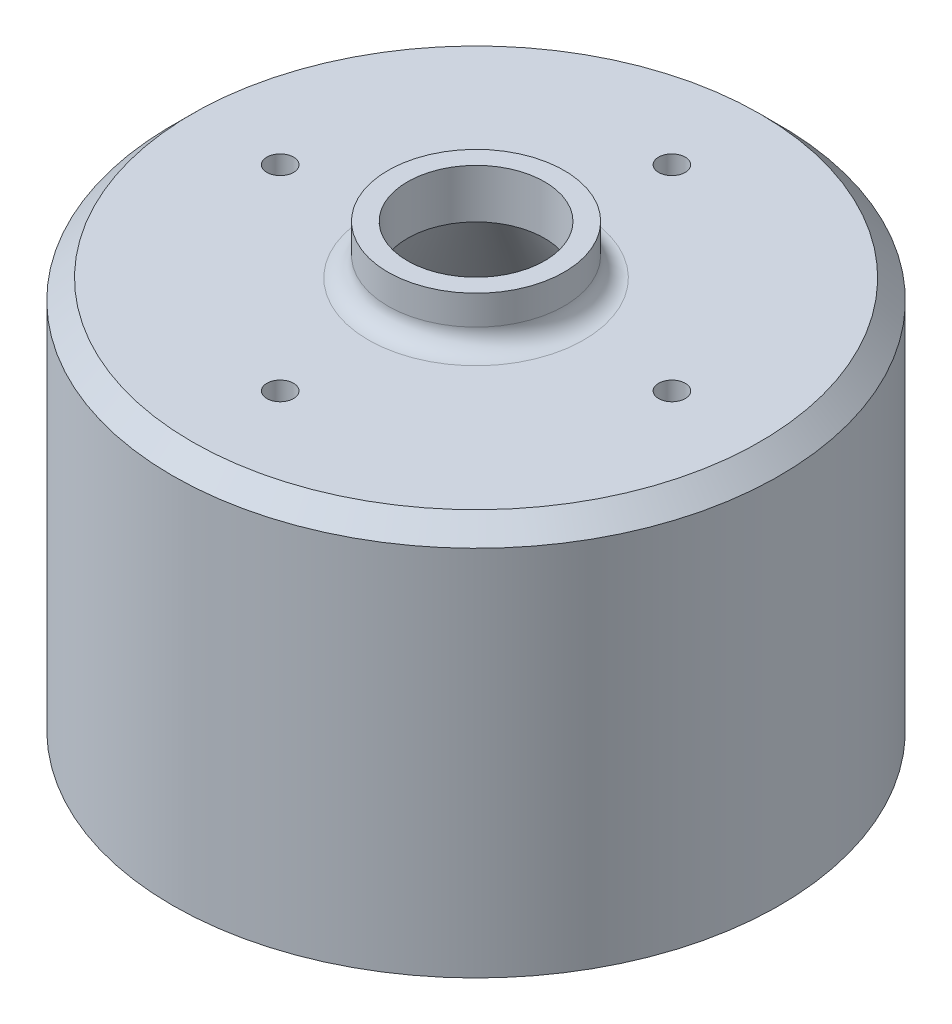
ISO-10303-21;
HEADER;
FILE_DESCRIPTION(('STEP AP214'),'2;1');
FILE_NAME('part.step','',(''),(''),'','','');
FILE_SCHEMA(('AUTOMOTIVE_DESIGN { 1 0 10303 214 1 1 1 1 }'));
ENDSEC;
DATA;
#1=APPLICATION_CONTEXT('core data for automotive mechanical design processes');
#2=APPLICATION_PROTOCOL_DEFINITION('international standard','automotive_design',2000,#1);
#3=PRODUCT_CONTEXT('',#1,'mechanical');
#4=PRODUCT('Part','Part','',(#3));
#5=PRODUCT_RELATED_PRODUCT_CATEGORY('part','',(#4));
#6=PRODUCT_DEFINITION_FORMATION('','',#4);
#7=PRODUCT_DEFINITION_CONTEXT('part definition',#1,'design');
#8=PRODUCT_DEFINITION('design','',#6,#7);
#9=PRODUCT_DEFINITION_SHAPE('','',#8);
#10=(LENGTH_UNIT() NAMED_UNIT(*) SI_UNIT(.MILLI.,.METRE.));
#11=(NAMED_UNIT(*) PLANE_ANGLE_UNIT() SI_UNIT($,.RADIAN.));
#12=(NAMED_UNIT(*) SI_UNIT($,.STERADIAN.) SOLID_ANGLE_UNIT());
#13=UNCERTAINTY_MEASURE_WITH_UNIT(LENGTH_MEASURE(1.E-05),#10,'distance_accuracy_value','');
#14=(GEOMETRIC_REPRESENTATION_CONTEXT(3) GLOBAL_UNCERTAINTY_ASSIGNED_CONTEXT((#13)) GLOBAL_UNIT_ASSIGNED_CONTEXT((#10,
#11,#12)) REPRESENTATION_CONTEXT('',''));
#15=CARTESIAN_POINT('',(0.,0.,0.));
#16=DIRECTION('',(0.,0.,1.));
#17=DIRECTION('',(1.,0.,0.));
#18=AXIS2_PLACEMENT_3D('',#15,#16,#17);
#19=CARTESIAN_POINT('',(-11.43,26.0054557310648,0.));
#20=DIRECTION('',(0.,1.,0.));
#21=DIRECTION('',(0.,0.,1.));
#22=AXIS2_PLACEMENT_3D('',#19,#20,#21);
#23=PLANE('',#22);
#24=CARTESIAN_POINT('',(0.,26.0054557310648,0.));
#25=DIRECTION('',(0.,1.,0.));
#26=DIRECTION('',(0.,0.,1.));
#27=AXIS2_PLACEMENT_3D('',#24,#25,#26);
#28=CIRCLE('',#27,11.43);
#29=CARTESIAN_POINT('',(0.,26.0054557310648,11.43));
#30=VERTEX_POINT('',#29);
#31=EDGE_CURVE('E93',#30,#30,#28,.T.);
#32=ORIENTED_EDGE('',*,*,#31,.T.);
#33=EDGE_LOOP('',(#32));
#34=FACE_BOUND('',#33,.T.);
#35=CARTESIAN_POINT('',(0.,26.0054557310648,0.));
#36=DIRECTION('',(0.,1.,0.));
#37=DIRECTION('',(0.,0.,1.));
#38=AXIS2_PLACEMENT_3D('',#35,#36,#37);
#39=CIRCLE('',#38,8.89);
#40=CARTESIAN_POINT('',(0.,26.0054557310648,8.89));
#41=VERTEX_POINT('',#40);
#42=EDGE_CURVE('E105',#41,#41,#39,.T.);
#43=ORIENTED_EDGE('',*,*,#42,.F.);
#44=EDGE_LOOP('',(#43));
#45=FACE_BOUND('',#44,.T.);
#46=ADVANCED_FACE('F39',(#34,#45),#23,.T.);
#47=CARTESIAN_POINT('',(0.,33.4946338173687,0.));
#48=DIRECTION('',(0.,1.,0.));
#49=DIRECTION('',(0.,0.,1.));
#50=AXIS2_PLACEMENT_3D('',#47,#48,#49);
#51=CYLINDRICAL_SURFACE('',#50,8.89);
#52=ORIENTED_EDGE('',*,*,#42,.T.);
#53=EDGE_LOOP('',(#52));
#54=FACE_BOUND('',#53,.T.);
#55=CARTESIAN_POINT('',(0.,19.6554557310648,0.));
#56=DIRECTION('',(0.,1.,0.));
#57=DIRECTION('',(0.,0.,1.));
#58=AXIS2_PLACEMENT_3D('',#55,#56,#57);
#59=CIRCLE('',#58,8.89);
#60=CARTESIAN_POINT('',(0.,19.6554557310648,8.89));
#61=VERTEX_POINT('',#60);
#62=EDGE_CURVE('E102',#61,#61,#59,.T.);
#63=ORIENTED_EDGE('',*,*,#62,.F.);
#64=EDGE_LOOP('',(#63));
#65=FACE_BOUND('',#64,.T.);
#66=ADVANCED_FACE('F133',(#54,#65),#51,.F.);
#67=CARTESIAN_POINT('',(0.,-31.1445442689352,0.));
#68=DIRECTION('',(0.,-1.,0.));
#69=DIRECTION('',(0.,0.,-1.));
#70=AXIS2_PLACEMENT_3D('',#67,#68,#69);
#71=CONICAL_SURFACE('',#70,38.2193936748333,0.523598775598304);
#72=ORIENTED_EDGE('',*,*,#62,.T.);
#73=EDGE_LOOP('',(#72));
#74=FACE_BOUND('',#73,.T.);
#75=CARTESIAN_POINT('',(0.,-31.1445442689352,0.));
#76=DIRECTION('',(0.,1.,0.));
#77=DIRECTION('',(0.,0.,1.));
#78=AXIS2_PLACEMENT_3D('',#75,#76,#77);
#79=CIRCLE('',#78,38.2193936748333);
#80=CARTESIAN_POINT('',(0.,-31.1445442689352,38.2193936748333));
#81=VERTEX_POINT('',#80);
#82=EDGE_CURVE('E99',#81,#81,#79,.T.);
#83=ORIENTED_EDGE('',*,*,#82,.F.);
#84=EDGE_LOOP('',(#83));
#85=FACE_BOUND('',#84,.T.);
#86=ADVANCED_FACE('F139',(#74,#85),#71,.F.);
#87=CARTESIAN_POINT('',(-38.2193936748333,-31.1445442689352,0.));
#88=DIRECTION('',(0.,-1.,0.));
#89=DIRECTION('',(0.,0.,-1.));
#90=AXIS2_PLACEMENT_3D('',#87,#88,#89);
#91=PLANE('',#90);
#92=ORIENTED_EDGE('',*,*,#82,.T.);
#93=EDGE_LOOP('',(#92));
#94=FACE_BOUND('',#93,.T.);
#95=CARTESIAN_POINT('',(0.,-31.1445442689352,0.));
#96=DIRECTION('',(0.,1.,0.));
#97=DIRECTION('',(0.,0.,1.));
#98=AXIS2_PLACEMENT_3D('',#95,#96,#97);
#99=CIRCLE('',#98,39.37);
#100=CARTESIAN_POINT('',(0.,-31.1445442689352,39.37));
#101=VERTEX_POINT('',#100);
#102=EDGE_CURVE('E96',#101,#101,#99,.T.);
#103=ORIENTED_EDGE('',*,*,#102,.F.);
#104=EDGE_LOOP('',(#103));
#105=FACE_BOUND('',#104,.T.);
#106=ADVANCED_FACE('F146',(#94,#105),#91,.T.);
#107=CARTESIAN_POINT('',(0.,33.4946338173687,0.));
#108=DIRECTION('',(0.,1.,0.));
#109=DIRECTION('',(0.,0.,1.));
#110=AXIS2_PLACEMENT_3D('',#107,#108,#109);
#111=CYLINDRICAL_SURFACE('',#110,39.37);
#112=CARTESIAN_POINT('',(0.,17.1154557310648,0.));
#113=DIRECTION('',(0.,1.,0.));
#114=DIRECTION('',(0.,0.,1.));
#115=AXIS2_PLACEMENT_3D('',#112,#113,#114);
#116=CIRCLE('',#115,39.37);
#117=CARTESIAN_POINT('',(0.,17.1154557310648,39.37));
#118=VERTEX_POINT('',#117);
#119=EDGE_CURVE('E11',#118,#118,#116,.F.);
#120=ORIENTED_EDGE('',*,*,#119,.T.);
#121=EDGE_LOOP('',(#120));
#122=FACE_BOUND('',#121,.T.);
#123=ORIENTED_EDGE('',*,*,#102,.T.);
#124=EDGE_LOOP('',(#123));
#125=FACE_BOUND('',#124,.T.);
#126=ADVANCED_FACE('F150',(#122,#125),#111,.T.);
#127=CARTESIAN_POINT('',(-39.37,19.6554557310648,0.));
#128=DIRECTION('',(0.,1.,0.));
#129=DIRECTION('',(0.,0.,1.));
#130=AXIS2_PLACEMENT_3D('',#127,#128,#129);
#131=PLANE('',#130);
#132=CARTESIAN_POINT('',(0.,19.6554557310648,25.4));
#133=DIRECTION('',(0.,1.,0.));
#134=DIRECTION('',(0.,0.,1.));
#135=AXIS2_PLACEMENT_3D('',#132,#133,#134);
#136=CIRCLE('',#135,1.7272);
#137=CARTESIAN_POINT('',(0.,19.6554557310648,27.1272));
#138=VERTEX_POINT('',#137);
#139=EDGE_CURVE('E71',#138,#138,#136,.T.);
#140=ORIENTED_EDGE('',*,*,#139,.F.);
#141=EDGE_LOOP('',(#140));
#142=FACE_BOUND('',#141,.T.);
#143=CARTESIAN_POINT('',(25.4,19.6554557310648,0.));
#144=DIRECTION('',(0.,1.,0.));
#145=DIRECTION('',(0.,0.,1.));
#146=AXIS2_PLACEMENT_3D('',#143,#144,#145);
#147=CIRCLE('',#146,1.7272);
#148=CARTESIAN_POINT('',(25.4,19.6554557310648,1.7272));
#149=VERTEX_POINT('',#148);
#150=EDGE_CURVE('E70',#149,#149,#147,.T.);
#151=ORIENTED_EDGE('',*,*,#150,.F.);
#152=EDGE_LOOP('',(#151));
#153=FACE_BOUND('',#152,.T.);
#154=CARTESIAN_POINT('',(0.,19.6554557310648,-25.4));
#155=DIRECTION('',(0.,1.,0.));
#156=DIRECTION('',(0.,0.,1.));
#157=AXIS2_PLACEMENT_3D('',#154,#155,#156);
#158=CIRCLE('',#157,1.7272);
#159=CARTESIAN_POINT('',(0.,19.6554557310648,-23.6728));
#160=VERTEX_POINT('',#159);
#161=EDGE_CURVE('E81',#160,#160,#158,.T.);
#162=ORIENTED_EDGE('',*,*,#161,.F.);
#163=EDGE_LOOP('',(#162));
#164=FACE_BOUND('',#163,.T.);
#165=CARTESIAN_POINT('',(-25.4,19.6554557310648,0.));
#166=DIRECTION('',(0.,1.,0.));
#167=DIRECTION('',(0.,0.,1.));
#168=AXIS2_PLACEMENT_3D('',#165,#166,#167);
#169=CIRCLE('',#168,1.7272);
#170=CARTESIAN_POINT('',(-25.4,19.6554557310648,1.7272));
#171=VERTEX_POINT('',#170);
#172=EDGE_CURVE('E87',#171,#171,#169,.T.);
#173=ORIENTED_EDGE('',*,*,#172,.F.);
#174=EDGE_LOOP('',(#173));
#175=FACE_BOUND('',#174,.T.);
#176=CARTESIAN_POINT('',(0.,19.6554557310648,0.));
#177=DIRECTION('',(0.,1.,0.));
#178=DIRECTION('',(0.,0.,1.));
#179=AXIS2_PLACEMENT_3D('',#176,#177,#178);
#180=CIRCLE('',#179,36.83);
#181=CARTESIAN_POINT('',(0.,19.6554557310648,36.83));
#182=VERTEX_POINT('',#181);
#183=EDGE_CURVE('E47',#182,#182,#180,.T.);
#184=ORIENTED_EDGE('',*,*,#183,.T.);
#185=EDGE_LOOP('',(#184));
#186=FACE_BOUND('',#185,.T.);
#187=CARTESIAN_POINT('',(0.,19.6554557310648,0.));
#188=DIRECTION('',(0.,1.,0.));
#189=DIRECTION('',(0.,0.,1.));
#190=AXIS2_PLACEMENT_3D('',#187,#188,#189);
#191=CIRCLE('',#190,13.97);
#192=CARTESIAN_POINT('',(0.,19.6554557310648,13.97));
#193=VERTEX_POINT('',#192);
#194=EDGE_CURVE('E111',#193,#193,#191,.F.);
#195=ORIENTED_EDGE('',*,*,#194,.T.);
#196=EDGE_LOOP('',(#195));
#197=FACE_BOUND('',#196,.T.);
#198=ADVANCED_FACE('F116',(#142,#153,#164,#175,#186,#197),#131,.T.);
#199=CARTESIAN_POINT('',(0.,33.4946338173687,0.));
#200=DIRECTION('',(0.,1.,0.));
#201=DIRECTION('',(0.,0.,1.));
#202=AXIS2_PLACEMENT_3D('',#199,#200,#201);
#203=CYLINDRICAL_SURFACE('',#202,11.43);
#204=CARTESIAN_POINT('',(0.,22.1954557310648,0.));
#205=DIRECTION('',(0.,1.,0.));
#206=DIRECTION('',(0.,0.,1.));
#207=AXIS2_PLACEMENT_3D('',#204,#205,#206);
#208=CIRCLE('',#207,11.43);
#209=CARTESIAN_POINT('',(0.,22.1954557310648,11.43));
#210=VERTEX_POINT('',#209);
#211=EDGE_CURVE('E108',#210,#210,#208,.T.);
#212=ORIENTED_EDGE('',*,*,#211,.T.);
#213=EDGE_LOOP('',(#212));
#214=FACE_BOUND('',#213,.T.);
#215=ORIENTED_EDGE('',*,*,#31,.F.);
#216=EDGE_LOOP('',(#215));
#217=FACE_BOUND('',#216,.T.);
#218=ADVANCED_FACE('F129',(#214,#217),#203,.T.);
#219=CARTESIAN_POINT('',(0.,22.1954557310648,0.));
#220=DIRECTION('',(0.,1.,0.));
#221=DIRECTION('',(0.,0.,1.));
#222=AXIS2_PLACEMENT_3D('',#219,#220,#221);
#223=TOROIDAL_SURFACE('',#222,13.97,2.54);
#224=ORIENTED_EDGE('',*,*,#194,.F.);
#225=EDGE_LOOP('',(#224));
#226=FACE_BOUND('',#225,.T.);
#227=ORIENTED_EDGE('',*,*,#211,.F.);
#228=EDGE_LOOP('',(#227));
#229=FACE_BOUND('',#228,.T.);
#230=ADVANCED_FACE('F121',(#226,#229),#223,.F.);
#231=CARTESIAN_POINT('',(0.,19.6554557310648,0.));
#232=DIRECTION('',(0.,-1.,0.));
#233=DIRECTION('',(0.,0.,-1.));
#234=AXIS2_PLACEMENT_3D('',#231,#232,#233);
#235=CONICAL_SURFACE('',#234,36.83,0.78539816339745);
#236=ORIENTED_EDGE('',*,*,#119,.F.);
#237=EDGE_LOOP('',(#236));
#238=FACE_BOUND('',#237,.T.);
#239=ORIENTED_EDGE('',*,*,#183,.F.);
#240=EDGE_LOOP('',(#239));
#241=FACE_BOUND('',#240,.T.);
#242=ADVANCED_FACE('F41',(#238,#241),#235,.T.);
#243=CARTESIAN_POINT('',(-25.4,8.98745573106477,0.));
#244=DIRECTION('',(0.,1.,0.));
#245=DIRECTION('',(0.,0.,1.));
#246=AXIS2_PLACEMENT_3D('',#243,#244,#245);
#247=CONICAL_SURFACE('',#246,1.7272,1.02974425867665);
#248=CARTESIAN_POINT('',(-25.4,7.94964926988036,0.));
#249=VERTEX_POINT('',#248);
#250=VERTEX_LOOP('',#249);
#251=FACE_BOUND('',#250,.T.);
#252=CARTESIAN_POINT('',(-25.4,8.98745573106477,0.));
#253=DIRECTION('',(0.,1.,0.));
#254=DIRECTION('',(0.,0.,1.));
#255=AXIS2_PLACEMENT_3D('',#252,#253,#254);
#256=CIRCLE('',#255,1.7272);
#257=CARTESIAN_POINT('',(-25.4,8.98745573106477,1.7272));
#258=VERTEX_POINT('',#257);
#259=EDGE_CURVE('E90',#258,#258,#256,.T.);
#260=ORIENTED_EDGE('',*,*,#259,.T.);
#261=EDGE_LOOP('',(#260));
#262=FACE_BOUND('',#261,.T.);
#263=ADVANCED_FACE('F120',(#251,#262),#247,.F.);
#264=CARTESIAN_POINT('',(-25.4,19.6554557310648,0.));
#265=DIRECTION('',(0.,1.,0.));
#266=DIRECTION('',(0.,0.,1.));
#267=AXIS2_PLACEMENT_3D('',#264,#265,#266);
#268=CYLINDRICAL_SURFACE('',#267,1.7272);
#269=ORIENTED_EDGE('',*,*,#259,.F.);
#270=EDGE_LOOP('',(#269));
#271=FACE_BOUND('',#270,.T.);
#272=ORIENTED_EDGE('',*,*,#172,.T.);
#273=EDGE_LOOP('',(#272));
#274=FACE_BOUND('',#273,.T.);
#275=ADVANCED_FACE('F127',(#271,#274),#268,.F.);
#276=CARTESIAN_POINT('',(0.,8.98745573106477,-25.4));
#277=DIRECTION('',(0.,1.,0.));
#278=DIRECTION('',(0.,0.,1.));
#279=AXIS2_PLACEMENT_3D('',#276,#277,#278);
#280=CONICAL_SURFACE('',#279,1.7272,1.02974425867665);
#281=CARTESIAN_POINT('',(0.,7.94964926988036,-25.4));
#282=VERTEX_POINT('',#281);
#283=VERTEX_LOOP('',#282);
#284=FACE_BOUND('',#283,.T.);
#285=CARTESIAN_POINT('',(0.,8.98745573106477,-25.4));
#286=DIRECTION('',(0.,1.,0.));
#287=DIRECTION('',(0.,0.,1.));
#288=AXIS2_PLACEMENT_3D('',#285,#286,#287);
#289=CIRCLE('',#288,1.7272);
#290=CARTESIAN_POINT('',(0.,8.98745573106477,-23.6728));
#291=VERTEX_POINT('',#290);
#292=EDGE_CURVE('E84',#291,#291,#289,.T.);
#293=ORIENTED_EDGE('',*,*,#292,.T.);
#294=EDGE_LOOP('',(#293));
#295=FACE_BOUND('',#294,.T.);
#296=ADVANCED_FACE('F163',(#284,#295),#280,.F.);
#297=CARTESIAN_POINT('',(0.,19.6554557310648,-25.4));
#298=DIRECTION('',(0.,1.,0.));
#299=DIRECTION('',(0.,0.,1.));
#300=AXIS2_PLACEMENT_3D('',#297,#298,#299);
#301=CYLINDRICAL_SURFACE('',#300,1.7272);
#302=ORIENTED_EDGE('',*,*,#292,.F.);
#303=EDGE_LOOP('',(#302));
#304=FACE_BOUND('',#303,.T.);
#305=ORIENTED_EDGE('',*,*,#161,.T.);
#306=EDGE_LOOP('',(#305));
#307=FACE_BOUND('',#306,.T.);
#308=ADVANCED_FACE('F167',(#304,#307),#301,.F.);
#309=CARTESIAN_POINT('',(25.4,8.98745573106477,0.));
#310=DIRECTION('',(0.,1.,0.));
#311=DIRECTION('',(0.,0.,1.));
#312=AXIS2_PLACEMENT_3D('',#309,#310,#311);
#313=CONICAL_SURFACE('',#312,1.7272,1.02974425867665);
#314=CARTESIAN_POINT('',(25.4,7.94964926988036,0.));
#315=VERTEX_POINT('',#314);
#316=VERTEX_LOOP('',#315);
#317=FACE_BOUND('',#316,.T.);
#318=CARTESIAN_POINT('',(25.4,8.98745573106477,0.));
#319=DIRECTION('',(0.,1.,0.));
#320=DIRECTION('',(0.,0.,1.));
#321=AXIS2_PLACEMENT_3D('',#318,#319,#320);
#322=CIRCLE('',#321,1.7272);
#323=CARTESIAN_POINT('',(25.4,8.98745573106477,1.7272));
#324=VERTEX_POINT('',#323);
#325=EDGE_CURVE('E74',#324,#324,#322,.T.);
#326=ORIENTED_EDGE('',*,*,#325,.T.);
#327=EDGE_LOOP('',(#326));
#328=FACE_BOUND('',#327,.T.);
#329=ADVANCED_FACE('F170',(#317,#328),#313,.F.);
#330=CARTESIAN_POINT('',(25.4,19.6554557310648,0.));
#331=DIRECTION('',(0.,1.,0.));
#332=DIRECTION('',(0.,0.,1.));
#333=AXIS2_PLACEMENT_3D('',#330,#331,#332);
#334=CYLINDRICAL_SURFACE('',#333,1.7272);
#335=ORIENTED_EDGE('',*,*,#325,.F.);
#336=EDGE_LOOP('',(#335));
#337=FACE_BOUND('',#336,.T.);
#338=ORIENTED_EDGE('',*,*,#150,.T.);
#339=EDGE_LOOP('',(#338));
#340=FACE_BOUND('',#339,.T.);
#341=ADVANCED_FACE('F64',(#337,#340),#334,.F.);
#342=CARTESIAN_POINT('',(0.,8.98745573106477,25.4));
#343=DIRECTION('',(0.,1.,0.));
#344=DIRECTION('',(0.,0.,1.));
#345=AXIS2_PLACEMENT_3D('',#342,#343,#344);
#346=CONICAL_SURFACE('',#345,1.7272,1.02974425867665);
#347=CARTESIAN_POINT('',(0.,7.94964926988036,25.4));
#348=VERTEX_POINT('',#347);
#349=VERTEX_LOOP('',#348);
#350=FACE_BOUND('',#349,.T.);
#351=CARTESIAN_POINT('',(0.,8.98745573106477,25.4));
#352=DIRECTION('',(0.,1.,0.));
#353=DIRECTION('',(0.,0.,1.));
#354=AXIS2_PLACEMENT_3D('',#351,#352,#353);
#355=CIRCLE('',#354,1.7272);
#356=CARTESIAN_POINT('',(0.,8.98745573106477,27.1272));
#357=VERTEX_POINT('',#356);
#358=EDGE_CURVE('E68',#357,#357,#355,.T.);
#359=ORIENTED_EDGE('',*,*,#358,.T.);
#360=EDGE_LOOP('',(#359));
#361=FACE_BOUND('',#360,.T.);
#362=ADVANCED_FACE('F60',(#350,#361),#346,.F.);
#363=CARTESIAN_POINT('',(0.,19.6554557310648,25.4));
#364=DIRECTION('',(0.,1.,0.));
#365=DIRECTION('',(0.,0.,1.));
#366=AXIS2_PLACEMENT_3D('',#363,#364,#365);
#367=CYLINDRICAL_SURFACE('',#366,1.7272);
#368=ORIENTED_EDGE('',*,*,#358,.F.);
#369=EDGE_LOOP('',(#368));
#370=FACE_BOUND('',#369,.T.);
#371=ORIENTED_EDGE('',*,*,#139,.T.);
#372=EDGE_LOOP('',(#371));
#373=FACE_BOUND('',#372,.T.);
#374=ADVANCED_FACE('F63',(#370,#373),#367,.F.);
#375=CLOSED_SHELL('',(#46,#66,#86,#106,#126,#198,#218,#230,#242,#263,#275,#296,#308,#329,#341,
#362,#374));
#376=MANIFOLD_SOLID_BREP('B2',#375);
#377=ADVANCED_BREP_SHAPE_REPRESENTATION('',(#18,#376),#14);
#378=SHAPE_DEFINITION_REPRESENTATION(#9,#377);
ENDSEC;
END-ISO-10303-21;
